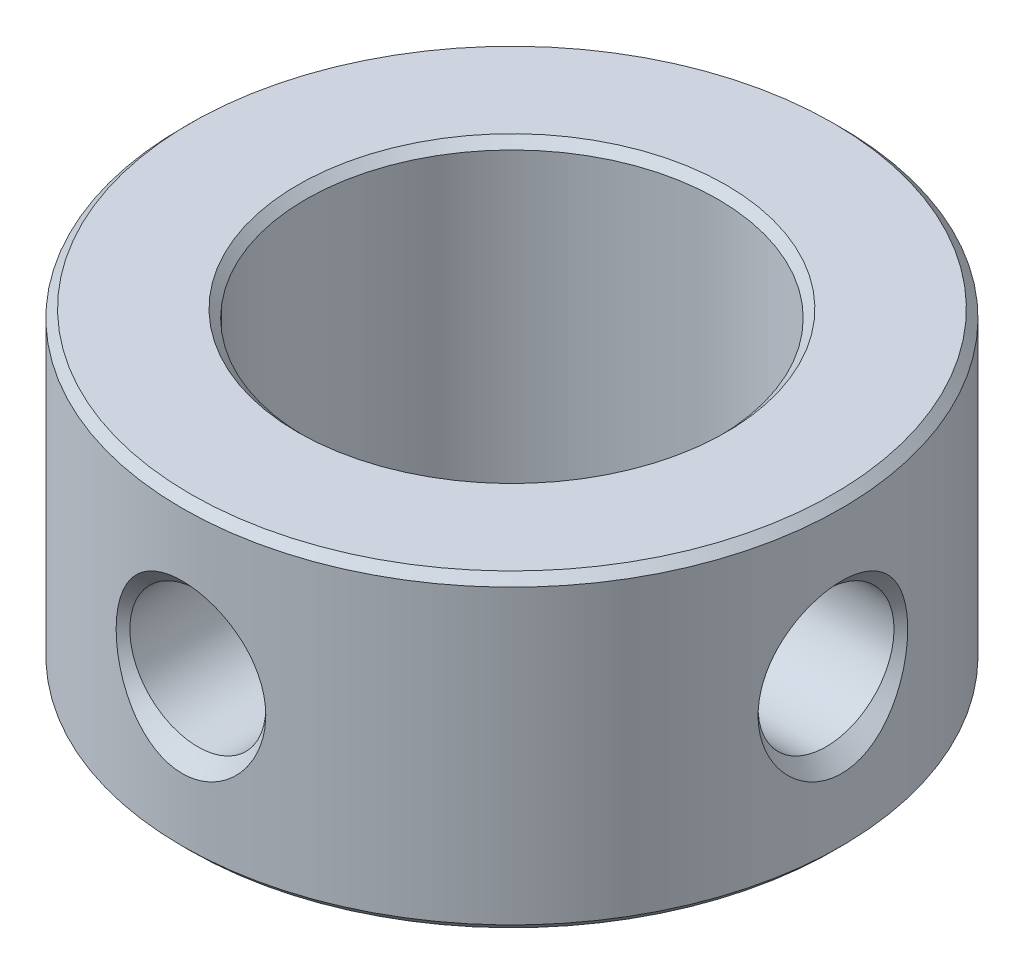
ISO-10303-21;
HEADER;
FILE_DESCRIPTION(('STEP AP214'),'2;1');
FILE_NAME('part.step','',(''),(''),'','','');
FILE_SCHEMA(('AUTOMOTIVE_DESIGN { 1 0 10303 214 1 1 1 1 }'));
ENDSEC;
DATA;
#1=APPLICATION_CONTEXT('core data for automotive mechanical design processes');
#2=APPLICATION_PROTOCOL_DEFINITION('international standard','automotive_design',2000,#1);
#3=PRODUCT_CONTEXT('',#1,'mechanical');
#4=PRODUCT('Part','Part','',(#3));
#5=PRODUCT_RELATED_PRODUCT_CATEGORY('part','',(#4));
#6=PRODUCT_DEFINITION_FORMATION('','',#4);
#7=PRODUCT_DEFINITION_CONTEXT('part definition',#1,'design');
#8=PRODUCT_DEFINITION('design','',#6,#7);
#9=PRODUCT_DEFINITION_SHAPE('','',#8);
#10=(LENGTH_UNIT() NAMED_UNIT(*) SI_UNIT(.MILLI.,.METRE.));
#11=(NAMED_UNIT(*) PLANE_ANGLE_UNIT() SI_UNIT($,.RADIAN.));
#12=(NAMED_UNIT(*) SI_UNIT($,.STERADIAN.) SOLID_ANGLE_UNIT());
#13=UNCERTAINTY_MEASURE_WITH_UNIT(LENGTH_MEASURE(1.E-05),#10,'distance_accuracy_value','');
#14=(GEOMETRIC_REPRESENTATION_CONTEXT(3) GLOBAL_UNCERTAINTY_ASSIGNED_CONTEXT((#13)) GLOBAL_UNIT_ASSIGNED_CONTEXT((#10,
#11,#12)) REPRESENTATION_CONTEXT('',''));
#15=CARTESIAN_POINT('',(0.,0.,0.));
#16=DIRECTION('',(0.,0.,1.));
#17=DIRECTION('',(1.,0.,0.));
#18=AXIS2_PLACEMENT_3D('',#15,#16,#17);
#19=CARTESIAN_POINT('',(0.,3.75,0.));
#20=DIRECTION('',(0.,1.,0.));
#21=DIRECTION('',(0.,0.,1.));
#22=AXIS2_PLACEMENT_3D('',#19,#20,#21);
#23=PLANE('',#22);
#24=CARTESIAN_POINT('',(0.,3.75,0.));
#25=DIRECTION('',(0.,1.,0.));
#26=DIRECTION('',(0.,0.,1.));
#27=AXIS2_PLACEMENT_3D('',#24,#25,#26);
#28=CIRCLE('',#27,5.2);
#29=CARTESIAN_POINT('',(0.,3.75,5.2));
#30=VERTEX_POINT('',#29);
#31=EDGE_CURVE('E39',#30,#30,#28,.F.);
#32=ORIENTED_EDGE('',*,*,#31,.T.);
#33=EDGE_LOOP('',(#32));
#34=FACE_BOUND('',#33,.T.);
#35=CARTESIAN_POINT('',(0.,3.75,0.));
#36=DIRECTION('',(0.,1.,0.));
#37=DIRECTION('',(0.,0.,1.));
#38=AXIS2_PLACEMENT_3D('',#35,#36,#37);
#39=CIRCLE('',#38,7.8);
#40=CARTESIAN_POINT('',(0.,3.75,7.8));
#41=VERTEX_POINT('',#40);
#42=EDGE_CURVE('E61',#41,#41,#39,.T.);
#43=ORIENTED_EDGE('',*,*,#42,.T.);
#44=EDGE_LOOP('',(#43));
#45=FACE_BOUND('',#44,.T.);
#46=ADVANCED_FACE('F32',(#34,#45),#23,.T.);
#47=CARTESIAN_POINT('',(0.,-3.75,0.));
#48=DIRECTION('',(0.,1.,0.));
#49=DIRECTION('',(0.,0.,1.));
#50=AXIS2_PLACEMENT_3D('',#47,#48,#49);
#51=PLANE('',#50);
#52=CARTESIAN_POINT('',(0.,-3.75,0.));
#53=DIRECTION('',(0.,1.,0.));
#54=DIRECTION('',(0.,0.,1.));
#55=AXIS2_PLACEMENT_3D('',#52,#53,#54);
#56=CIRCLE('',#55,5.2);
#57=CARTESIAN_POINT('',(0.,-3.75,5.2));
#58=VERTEX_POINT('',#57);
#59=EDGE_CURVE('E10',#58,#58,#56,.T.);
#60=ORIENTED_EDGE('',*,*,#59,.T.);
#61=EDGE_LOOP('',(#60));
#62=FACE_BOUND('',#61,.T.);
#63=CARTESIAN_POINT('',(0.,-3.75,0.));
#64=DIRECTION('',(0.,1.,0.));
#65=DIRECTION('',(0.,0.,1.));
#66=AXIS2_PLACEMENT_3D('',#63,#64,#65);
#67=CIRCLE('',#66,7.8);
#68=CARTESIAN_POINT('',(0.,-3.75,7.8));
#69=VERTEX_POINT('',#68);
#70=EDGE_CURVE('E52',#69,#69,#67,.F.);
#71=ORIENTED_EDGE('',*,*,#70,.T.);
#72=EDGE_LOOP('',(#71));
#73=FACE_BOUND('',#72,.T.);
#74=ADVANCED_FACE('F130',(#62,#73),#51,.F.);
#75=CARTESIAN_POINT('',(0.,3.75,0.));
#76=DIRECTION('',(0.,-1.,0.));
#77=DIRECTION('',(0.,0.,-1.));
#78=AXIS2_PLACEMENT_3D('',#75,#76,#77);
#79=CYLINDRICAL_SURFACE('',#78,8.);
#80=CARTESIAN_POINT('',(0.,3.55,0.));
#81=DIRECTION('',(0.,1.,0.));
#82=DIRECTION('',(0.,0.,1.));
#83=AXIS2_PLACEMENT_3D('',#80,#81,#82);
#84=CIRCLE('',#83,8.);
#85=CARTESIAN_POINT('',(0.,3.55,8.));
#86=VERTEX_POINT('',#85);
#87=EDGE_CURVE('E55',#86,#86,#84,.F.);
#88=ORIENTED_EDGE('',*,*,#87,.T.);
#89=EDGE_LOOP('',(#88));
#90=FACE_BOUND('',#89,.T.);
#91=CARTESIAN_POINT('',(0.,-3.55,0.));
#92=DIRECTION('',(0.,1.,0.));
#93=DIRECTION('',(0.,0.,1.));
#94=AXIS2_PLACEMENT_3D('',#91,#92,#93);
#95=CIRCLE('',#94,8.);
#96=CARTESIAN_POINT('',(0.,-3.55,8.));
#97=VERTEX_POINT('',#96);
#98=EDGE_CURVE('E58',#97,#97,#95,.T.);
#99=ORIENTED_EDGE('',*,*,#98,.T.);
#100=EDGE_LOOP('',(#99));
#101=FACE_BOUND('',#100,.T.);
#102=CARTESIAN_POINT('',(7.88725510410815,-1.36583766069958,-1.33835982872653));
#103=CARTESIAN_POINT('',(7.89739681602595,-1.43860886980372,-1.27858819017871));
#104=CARTESIAN_POINT('',(7.90772236569113,-1.50707948431465,-1.21362903791426));
#105=CARTESIAN_POINT('',(7.92787502445625,-1.63362294887884,-1.07413303537246));
#106=CARTESIAN_POINT('',(7.93770205357823,-1.6916941343025,-0.999594655028545));
#107=CARTESIAN_POINT('',(7.95716516063902,-1.80241936115597,-0.831607884611095));
#108=CARTESIAN_POINT('',(7.96660095694601,-1.85331785735637,-0.736963327628972));
#109=CARTESIAN_POINT('',(7.982396744113,-1.93647240518105,-0.539544563384977));
#110=CARTESIAN_POINT('',(7.98875829366974,-1.96873790568088,-0.436774506714666));
#111=CARTESIAN_POINT('',(7.99700095825641,-2.01018882512739,-0.238229006284151));
#112=CARTESIAN_POINT('',(7.9992953182243,-2.02150900809473,-0.142914450717224));
#113=CARTESIAN_POINT('',(8.00042440745517,-2.02710324197324,0.0482111537547259));
#114=CARTESIAN_POINT('',(7.99926078640053,-2.02138542111946,0.144021944152301));
#115=CARTESIAN_POINT('',(7.99380789774318,-1.99416593034385,0.326922187659782));
#116=CARTESIAN_POINT('',(7.98972476106583,-1.97370452140549,0.414175918319122));
#117=CARTESIAN_POINT('',(7.97910030835475,-1.91915163233458,0.584135608897859));
#118=CARTESIAN_POINT('',(7.97255870881883,-1.88505858021489,0.666841043060651));
#119=CARTESIAN_POINT('',(7.95738687903795,-1.80318419683851,0.82876674905741));
#120=CARTESIAN_POINT('',(7.9486892340512,-1.75494939533931,0.907750249633318));
#121=CARTESIAN_POINT('',(7.93017220762528,-1.64713715678737,1.05738570632043));
#122=CARTESIAN_POINT('',(7.92035241249931,-1.58755553123552,1.12803457018853));
#123=CARTESIAN_POINT('',(7.89941121101303,-1.45218649368848,1.26677808538215));
#124=CARTESIAN_POINT('',(7.88826015872866,-1.37536068144245,1.33385442115752));
#125=CARTESIAN_POINT('',(7.86669776635073,-1.21238042514961,1.45564388248628));
#126=CARTESIAN_POINT('',(7.85628676496414,-1.12622175458668,1.51035137171919));
#127=CARTESIAN_POINT('',(7.83611566328109,-0.937065986120456,1.61191323576617));
#128=CARTESIAN_POINT('',(7.82654571973213,-0.833254354326015,1.65729205131895));
#129=CARTESIAN_POINT('',(7.81048343977299,-0.619627250981955,1.73141257860072));
#130=CARTESIAN_POINT('',(7.80399203833629,-0.509809966755655,1.76014923658219));
#131=CARTESIAN_POINT('',(7.79447842525019,-0.27991358871225,1.80183370353196));
#132=CARTESIAN_POINT('',(7.79169935219886,-0.159622885683257,1.81367812307864));
#133=CARTESIAN_POINT('',(7.79071655129548,0.0813242980254866,1.81789379949077));
#134=CARTESIAN_POINT('',(7.79251348293863,0.201980828925408,1.81026224947317));
#135=CARTESIAN_POINT('',(7.80054081493752,0.442372326981624,1.7753559314282));
#136=CARTESIAN_POINT('',(7.80684577673287,0.562057088444893,1.74775071193633));
#137=CARTESIAN_POINT('',(7.82320831570274,0.794920823331452,1.67298153005878));
#138=CARTESIAN_POINT('',(7.83326642968549,0.908098863433606,1.62581476970511));
#139=CARTESIAN_POINT('',(7.8557615153723,1.12313944347954,1.51335754480519));
#140=CARTESIAN_POINT('',(7.86816930475247,1.2251187917495,1.44828538444375));
#141=CARTESIAN_POINT('',(7.8938768653106,1.4156756843124,1.30087822336123));
#142=CARTESIAN_POINT('',(7.90717643647745,1.50425621931093,1.21854708477827));
#143=CARTESIAN_POINT('',(7.93205598389675,1.65919652610796,1.0439183091388));
#144=CARTESIAN_POINT('',(7.94369143622925,1.72659113693389,0.952550876440163));
#145=CARTESIAN_POINT('',(7.96456379203474,1.84277418464639,0.758418357442723));
#146=CARTESIAN_POINT('',(7.97380332981378,1.89158308441554,0.655665967906818));
#147=CARTESIAN_POINT('',(7.98762272239615,1.96311251471819,0.454755021393487));
#148=CARTESIAN_POINT('',(7.99262270035408,1.98822558163853,0.357476680579581));
#149=CARTESIAN_POINT('',(7.99901139448469,2.02016152017765,0.159861723506759));
#150=CARTESIAN_POINT('',(8.00040267039491,2.02699735637364,0.0595273261202028));
#151=CARTESIAN_POINT('',(7.99944025778874,2.02222530139168,-0.131030873444452));
#152=CARTESIAN_POINT('',(7.99743190952356,2.01231833775373,-0.221304159775034));
#153=CARTESIAN_POINT('',(7.99054508022457,1.97775263823959,-0.398850479403227));
#154=CARTESIAN_POINT('',(7.9856666826559,1.95309433135319,-0.486123599871834));
#155=CARTESIAN_POINT('',(7.97355584474197,1.89016586582776,-0.655461411830023));
#156=CARTESIAN_POINT('',(7.96632197752287,1.85188745522586,-0.73752291017412));
#157=CARTESIAN_POINT('',(7.95021021509912,1.76327155506703,-0.894654460328953));
#158=CARTESIAN_POINT('',(7.94133184962581,1.71293061483856,-0.969722503005037));
#159=CARTESIAN_POINT('',(7.921917011649,1.59708467974292,-1.11771001358868));
#160=CARTESIAN_POINT('',(7.91130359382215,1.53064727306536,-1.18988805283623));
#161=CARTESIAN_POINT('',(7.89007021317852,1.38765606785779,-1.32339382956808));
#162=CARTESIAN_POINT('',(7.8794502495856,1.31109766543021,-1.38471659927193));
#163=CARTESIAN_POINT('',(7.85798085899198,1.14072801483068,-1.50202982280101));
#164=CARTESIAN_POINT('',(7.84724155731489,1.04594478277444,-1.5566307316863));
#165=CARTESIAN_POINT('',(7.82799816344493,0.848930221936532,-1.65068273917688));
#166=CARTESIAN_POINT('',(7.81949489862135,0.746696154046492,-1.69012823251909));
#167=CARTESIAN_POINT('',(7.80499578448182,0.528709414280086,-1.75592750188839));
#168=CARTESIAN_POINT('',(7.79926169102938,0.412534789575671,-1.7809476800683));
#169=CARTESIAN_POINT('',(7.79205132671697,0.177551728348718,-1.8122345302998));
#170=CARTESIAN_POINT('',(7.79057593281147,0.05874275443393,-1.81849733983059));
#171=CARTESIAN_POINT('',(7.79207545490378,-0.182003266117995,-1.8120640526144));
#172=CARTESIAN_POINT('',(7.79518858244532,-0.3039241877997,-1.79877917781435));
#173=CARTESIAN_POINT('',(7.80574842324515,-0.543764710507947,-1.7523846527222));
#174=CARTESIAN_POINT('',(7.81319545189167,-0.661684019666671,-1.71927355962423));
#175=CARTESIAN_POINT('',(7.83092678711152,-0.882708778771738,-1.63653469496718));
#176=CARTESIAN_POINT('',(7.84099879002972,-0.986279301981149,-1.58810079019202));
#177=CARTESIAN_POINT('',(7.86304408631651,-1.18392819467795,-1.47507360341182));
#178=CARTESIAN_POINT('',(7.87501571965002,-1.27801473564244,-1.41049440223918));
#179=CARTESIAN_POINT('',(7.88725510410815,-1.36583766069958,-1.33835982872653));
#180=B_SPLINE_CURVE_WITH_KNOTS('',3,(#102,#103,#104,#105,#106,#107,#108,#109,#110,#111,#112,
#113,#114,#115,#116,#117,#118,#119,#120,#121,#122,#123,#124,#125,#126,#127,#128,#129,#130,#131,
#132,#133,#134,#135,#136,#137,#138,#139,#140,#141,#142,#143,#144,#145,#146,#147,#148,#149,#150,
#151,#152,#153,#154,#155,#156,#157,#158,#159,#160,#161,#162,#163,#164,#165,#166,#167,#168,#169,
#170,#171,#172,#173,#174,#175,#176,#177,#178,#179),.UNSPECIFIED.,.T.,.F.,(4,2,2,2,2,2,2,2,2,2,2,
2,2,2,2,2,2,2,2,2,2,2,2,2,2,2,2,2,2,2,2,2,2,2,2,2,2,2,4),(0.,0.283859857117584,
0.567765110956834,0.889536386674303,1.21114434712809,1.49764929327823,1.78401757983654,
2.05194258314755,2.31989849221092,2.59761729430366,2.87543881126853,3.18196867125888,
3.48863793259663,3.82826063048602,4.16798640807391,4.52902098798788,4.89010760326087,
5.25730888976448,5.62456271670886,5.98752349049351,6.35040312905266,6.69085982591043,
7.03094058833071,7.331038105931,7.63092269899433,7.90213513353999,8.17333968123008,
8.44470882320707,8.71615568736035,9.0109730678795,9.30592502109126,9.63426740944553,
9.96273111930727,10.3180422537087,10.6734265488157,11.039736519123,11.4060731500071,
11.7489434755357,12.0915158096396),.UNSPECIFIED.);
#181=CARTESIAN_POINT('',(7.88725510410815,-1.36583766069958,-1.33835982872653));
#182=VERTEX_POINT('',#181);
#183=EDGE_CURVE('E64',#182,#182,#180,.T.);
#184=ORIENTED_EDGE('',*,*,#183,.T.);
#185=EDGE_LOOP('',(#184));
#186=FACE_BOUND('',#185,.T.);
#187=CARTESIAN_POINT('',(-1.3383598287265,-1.36583766069958,7.88725510410815));
#188=CARTESIAN_POINT('',(-1.41170413311371,-1.27653817882784,7.87481033742301));
#189=CARTESIAN_POINT('',(-1.47728321321789,-1.18070127703216,7.86263410077733));
#190=CARTESIAN_POINT('',(-1.59176194811959,-0.979204940478396,7.84026250833114));
#191=CARTESIAN_POINT('',(-1.64063087024733,-0.873527857197293,7.83007081708701));
#192=CARTESIAN_POINT('',(-1.72100770649194,-0.655091133582315,7.81279932035607));
#193=CARTESIAN_POINT('',(-1.75245256260931,-0.542307392377088,7.80573083626055));
#194=CARTESIAN_POINT('',(-1.79721374516216,-0.313086494214983,7.79554696727406));
#195=CARTESIAN_POINT('',(-1.81053688015437,-0.196650726200835,7.7924300977421));
#196=CARTESIAN_POINT('',(-1.81904965333753,0.0419496371192778,7.79044840047274));
#197=CARTESIAN_POINT('',(-1.81343508596477,0.164145319874912,7.79177213393712));
#198=CARTESIAN_POINT('',(-1.78237082975267,0.405885796890232,7.79893599143359));
#199=CARTESIAN_POINT('',(-1.75691593987457,0.525429887596353,7.80477729972163));
#200=CARTESIAN_POINT('',(-1.68645963505265,0.75885481478236,7.82030396805208));
#201=CARTESIAN_POINT('',(-1.64138610039736,0.872713011255727,7.83000349979347));
#202=CARTESIAN_POINT('',(-1.53239748276877,1.09080207316936,7.85205943100922));
#203=CARTESIAN_POINT('',(-1.46848116680311,1.19503230800995,7.86441600433489));
#204=CARTESIAN_POINT('',(-1.3250704044391,1.3872774167194,7.88982390575823));
#205=CARTESIAN_POINT('',(-1.24609465182157,1.47568176179882,7.90284372632592));
#206=CARTESIAN_POINT('',(-1.07297084581299,1.6363004280664,7.92819967782814));
#207=CARTESIAN_POINT('',(-0.978832865259455,1.70852542216726,7.94053625540476));
#208=CARTESIAN_POINT('',(-0.787030076589696,1.82731770905041,7.9617219126718));
#209=CARTESIAN_POINT('',(-0.690470253574915,1.87562446906329,7.97078646442859));
#210=CARTESIAN_POINT('',(-0.489711803581817,1.95302140304109,7.98562824690539));
#211=CARTESIAN_POINT('',(-0.385521721168743,1.98213271775377,7.99140909313206));
#212=CARTESIAN_POINT('',(-0.18611840636867,2.01702915490541,7.99838094852231));
#213=CARTESIAN_POINT('',(-0.0913348026614285,2.02520083501288,8.00004079092892));
#214=CARTESIAN_POINT('',(0.0981814392946561,2.02479191397994,7.9999577444807));
#215=CARTESIAN_POINT('',(0.192914083928997,2.016216989873,7.99821600874757));
#216=CARTESIAN_POINT('',(0.374003289245471,1.98376567188912,7.99173803777931));
#217=CARTESIAN_POINT('',(0.46052988835945,1.9607866990389,7.98717763348972));
#218=CARTESIAN_POINT('',(0.628679415872557,1.90144716299212,7.97570503521687));
#219=CARTESIAN_POINT('',(0.710301707322969,1.86508486598258,7.96879253652797));
#220=CARTESIAN_POINT('',(0.870391667878321,1.77854617945623,7.95293543091084));
#221=CARTESIAN_POINT('',(0.948556638930005,1.72782637451953,7.94391399059008));
#222=CARTESIAN_POINT('',(1.09621835901505,1.61521248988666,7.92488858608386));
#223=CARTESIAN_POINT('',(1.16571173187928,1.55331408076378,7.91488424191079));
#224=CARTESIAN_POINT('',(1.30191232300601,1.41307903493489,7.89368562523889));
#225=CARTESIAN_POINT('',(1.36753800863951,1.33369442678286,7.8824779152605));
#226=CARTESIAN_POINT('',(1.4860430517811,1.16581444462395,7.86099930986731));
#227=CARTESIAN_POINT('',(1.53891665740775,1.07731498491043,7.85072883849157));
#228=CARTESIAN_POINT('',(1.63611470115427,0.883731730973365,7.83108236883595));
#229=CARTESIAN_POINT('',(1.67895995805141,0.777882144775569,7.82191330282649));
#230=CARTESIAN_POINT('',(1.74767000674032,0.560586465619506,7.80684887109571));
#231=CARTESIAN_POINT('',(1.77352997303875,0.449138791925669,7.80095443576488));
#232=CARTESIAN_POINT('',(1.80887876512282,0.216902152056331,7.79283760008622));
#233=CARTESIAN_POINT('',(1.81733209770219,0.0959461112443887,7.7908477759683));
#234=CARTESIAN_POINT('',(1.81464742958053,-0.145744296975187,7.7914731272954));
#235=CARTESIAN_POINT('',(1.80350669045263,-0.26647863103682,7.79408894641563));
#236=CARTESIAN_POINT('',(1.76152385767787,-0.506060053600264,7.80368516511054));
#237=CARTESIAN_POINT('',(1.73040734534757,-0.624856843720785,7.81072632947477));
#238=CARTESIAN_POINT('',(1.64872343116766,-0.855325655395811,7.82837451415271));
#239=CARTESIAN_POINT('',(1.59815332973,-0.966996685595014,7.83898202934564));
#240=CARTESIAN_POINT('',(1.47927561951103,-1.17807996112887,7.86227372192069));
#241=CARTESIAN_POINT('',(1.41123986406191,-1.27764836563501,7.87492505729425));
#242=CARTESIAN_POINT('',(1.25825353702386,-1.46279884309713,7.90080963227325));
#243=CARTESIAN_POINT('',(1.1733080466252,-1.54838510350247,7.91404269614717));
#244=CARTESIAN_POINT('',(0.994621182199664,-1.69649578979629,7.93840583932307));
#245=CARTESIAN_POINT('',(0.901863873348556,-1.76018881338356,7.94961762825355));
#246=CARTESIAN_POINT('',(0.705664988223893,-1.86874128806348,7.96942289223697));
#247=CARTESIAN_POINT('',(0.602235621117201,-1.91362196979086,7.97801931583423));
#248=CARTESIAN_POINT('',(0.401060397434244,-1.97765789823812,7.9904984321935));
#249=CARTESIAN_POINT('',(0.304115949800717,-1.99924925220486,7.99482215755886));
#250=CARTESIAN_POINT('',(0.107841629003534,-2.02441256217658,7.99987355672001));
#251=CARTESIAN_POINT('',(0.00851338838205845,-2.02799651559412,8.00060362477978));
#252=CARTESIAN_POINT('',(-0.180230430545424,-2.01745078557005,7.99847716207752));
#253=CARTESIAN_POINT('',(-0.269740972253015,-2.00487029162763,7.99593427119143));
#254=CARTESIAN_POINT('',(-0.445377743557239,-1.96524927307519,7.98807665296964));
#255=CARTESIAN_POINT('',(-0.531503296905257,-1.9382058746896,7.98276137476646));
#256=CARTESIAN_POINT('',(-0.69904229317204,-1.87055291097395,7.96984839711081));
#257=CARTESIAN_POINT('',(-0.78039915647992,-1.8298086793638,7.96222811947579));
#258=CARTESIAN_POINT('',(-0.935736994232825,-1.73645763350549,7.94547054230361));
#259=CARTESIAN_POINT('',(-1.00972202455813,-1.68385739481996,7.93633408440632));
#260=CARTESIAN_POINT('',(-1.12667295604545,-1.58712058841723,7.92040967896829));
#261=CARTESIAN_POINT('',(-1.17195794372938,-1.54570947842631,7.91381239220112));
#262=CARTESIAN_POINT('',(-1.25834385495222,-1.45875820936235,7.90053657232343));
#263=CARTESIAN_POINT('',(-1.29944485336124,-1.41321812420256,7.89385804066914));
#264=CARTESIAN_POINT('',(-1.3383598287265,-1.36583766069958,7.88725510410815));
#265=B_SPLINE_CURVE_WITH_KNOTS('',3,(#187,#188,#189,#190,#191,#192,#193,#194,#195,#196,#197,
#198,#199,#200,#201,#202,#203,#204,#205,#206,#207,#208,#209,#210,#211,#212,#213,#214,#215,#216,
#217,#218,#219,#220,#221,#222,#223,#224,#225,#226,#227,#228,#229,#230,#231,#232,#233,#234,#235,
#236,#237,#238,#239,#240,#241,#242,#243,#244,#245,#246,#247,#248,#249,#250,#251,#252,#253,#254,
#255,#256,#257,#258,#259,#260,#261,#262,#263,#264),.UNSPECIFIED.,.T.,.F.,(4,2,2,2,2,2,2,2,2,2,2,
2,2,2,2,2,2,2,2,2,2,2,2,2,2,2,2,2,2,2,2,2,2,2,2,2,2,2,4),(0.,0.348450920185695,
0.697539293504841,1.04788290741681,1.39809485646919,1.76336284439314,2.12872661766384,
2.49544499338223,2.86218737093744,3.21804425101093,3.57366568977905,3.89684841573091,
4.21967460985182,4.50363082081152,4.78749078843241,5.05521647388626,5.32297685548439,
5.60267016425719,5.88247203029661,6.19201860048867,6.50170453298249,6.84388522012308,
7.18616307823845,7.54827492402963,7.91043738184359,8.27768474526009,8.64498309024284,
9.00687862877488,9.36866558536499,9.70597286323275,10.0428984419434,10.3394979167735,
10.635899756273,10.9059033573352,11.1759606279904,11.4487539131712,11.7213962727738,
11.9062804540758,12.0911613263988),.UNSPECIFIED.);
#266=CARTESIAN_POINT('',(-1.3383598287265,-1.36583766069958,7.88725510410815));
#267=VERTEX_POINT('',#266);
#268=EDGE_CURVE('E72',#267,#267,#265,.T.);
#269=ORIENTED_EDGE('',*,*,#268,.T.);
#270=EDGE_LOOP('',(#269));
#271=FACE_BOUND('',#270,.T.);
#272=ADVANCED_FACE('F78',(#90,#101,#186,#271),#79,.T.);
#273=CARTESIAN_POINT('',(0.,3.75,0.));
#274=DIRECTION('',(0.,-1.,0.));
#275=DIRECTION('',(0.,0.,-1.));
#276=AXIS2_PLACEMENT_3D('',#273,#274,#275);
#277=CYLINDRICAL_SURFACE('',#276,5.);
#278=CARTESIAN_POINT('',(0.,3.55,0.));
#279=DIRECTION('',(0.,1.,0.));
#280=DIRECTION('',(0.,0.,1.));
#281=AXIS2_PLACEMENT_3D('',#278,#279,#280);
#282=CIRCLE('',#281,5.);
#283=CARTESIAN_POINT('',(0.,3.55,5.));
#284=VERTEX_POINT('',#283);
#285=EDGE_CURVE('E43',#284,#284,#282,.T.);
#286=ORIENTED_EDGE('',*,*,#285,.T.);
#287=EDGE_LOOP('',(#286));
#288=FACE_BOUND('',#287,.T.);
#289=CARTESIAN_POINT('',(0.,-3.55,0.));
#290=DIRECTION('',(0.,1.,0.));
#291=DIRECTION('',(0.,0.,1.));
#292=AXIS2_PLACEMENT_3D('',#289,#290,#291);
#293=CIRCLE('',#292,5.);
#294=CARTESIAN_POINT('',(0.,-3.55,5.));
#295=VERTEX_POINT('',#294);
#296=EDGE_CURVE('E47',#295,#295,#293,.F.);
#297=ORIENTED_EDGE('',*,*,#296,.T.);
#298=EDGE_LOOP('',(#297));
#299=FACE_BOUND('',#298,.T.);
#300=CARTESIAN_POINT('',(4.71990466005405,0.,-1.65000000000002));
#301=CARTESIAN_POINT('',(4.71990452115882,-0.0899293992906261,-1.65000024360505));
#302=CARTESIAN_POINT('',(4.72250292266518,-0.179857686499693,-1.64262303818657));
#303=CARTESIAN_POINT('',(4.73256311651637,-0.357053673435176,-1.61340616817485));
#304=CARTESIAN_POINT('',(4.74002579119602,-0.444320887460395,-1.59156387973591));
#305=CARTESIAN_POINT('',(4.75887919770346,-0.613599699379074,-1.5342646581981));
#306=CARTESIAN_POINT('',(4.77026235105613,-0.695621077663532,-1.49883397722408));
#307=CARTESIAN_POINT('',(4.79566317693292,-0.852581496357103,-1.41545303535857));
#308=CARTESIAN_POINT('',(4.80968141232601,-0.927519018463693,-1.36750009878648));
#309=CARTESIAN_POINT('',(4.83937566103107,-1.07105763938824,-1.25846654308767));
#310=CARTESIAN_POINT('',(4.85509238793418,-1.13934748573353,-1.19698715979912));
#311=CARTESIAN_POINT('',(4.8860682262247,-1.26485926767889,-1.06349727663173));
#312=CARTESIAN_POINT('',(4.90132726544298,-1.322079465466,-0.991485126335493));
#313=CARTESIAN_POINT('',(4.93013890958224,-1.42523358902282,-0.836704215602416));
#314=CARTESIAN_POINT('',(4.94363804307574,-1.47084230640669,-0.75370788727838));
#315=CARTESIAN_POINT('',(4.9669298740668,-1.54732873484977,-0.580699685040902));
#316=CARTESIAN_POINT('',(4.97672354920831,-1.57821033205654,-0.490689669179521));
#317=CARTESIAN_POINT('',(4.99121262924257,-1.62331307187515,-0.309471831071075));
#318=CARTESIAN_POINT('',(4.99607073696453,-1.63806721498854,-0.218409916306862));
#319=CARTESIAN_POINT('',(5.00071837425094,-1.65218999871481,-0.0349820134684329));
#320=CARTESIAN_POINT('',(5.00050918484354,-1.65156252784608,0.0573836391159306));
#321=CARTESIAN_POINT('',(4.99515654976729,-1.63528002545685,0.237027933093908));
#322=CARTESIAN_POINT('',(4.99020313675408,-1.6202037350628,0.324365615952672));
#323=CARTESIAN_POINT('',(4.9761564157389,-1.57640739681431,0.495193577668994));
#324=CARTESIAN_POINT('',(4.96706282865059,-1.54768642917574,0.578683596740267));
#325=CARTESIAN_POINT('',(4.94551338736032,-1.47707262193577,0.740723104693046));
#326=CARTESIAN_POINT('',(4.93301533884174,-1.43501331574259,0.81919420758658));
#327=CARTESIAN_POINT('',(4.90596050876768,-1.33905332496135,0.968137400016363));
#328=CARTESIAN_POINT('',(4.89140316323876,-1.28514939427669,1.03860728872216));
#329=CARTESIAN_POINT('',(4.86097294536879,-1.16410482353283,1.17299175258729));
#330=CARTESIAN_POINT('',(4.84507036749807,-1.09646769426564,1.23645304594367));
#331=CARTESIAN_POINT('',(4.81431124792123,-0.951373410364429,1.3512770038306));
#332=CARTESIAN_POINT('',(4.79945486104327,-0.873914806958852,1.40263788022028));
#333=CARTESIAN_POINT('',(4.77230967313123,-0.709965601142442,1.49241382326106));
#334=CARTESIAN_POINT('',(4.76005891661915,-0.623365612338627,1.53064150543128));
#335=CARTESIAN_POINT('',(4.73995346804782,-0.444452392842491,1.59181981773762));
#336=CARTESIAN_POINT('',(4.73209697762928,-0.352141516541729,1.61477669819904));
#337=CARTESIAN_POINT('',(4.72207527963098,-0.168809832300748,1.64384682592319));
#338=CARTESIAN_POINT('',(4.71967327795615,-0.0779131556508038,1.65066145601708));
#339=CARTESIAN_POINT('',(4.72017136658521,0.103737847887934,1.64923749492085));
#340=CARTESIAN_POINT('',(4.72307051828915,0.194492197129191,1.64100156851916));
#341=CARTESIAN_POINT('',(4.73360855675225,0.370120072236671,1.61033997123773));
#342=CARTESIAN_POINT('',(4.7410857342646,0.455088769396758,1.58839792719589));
#343=CARTESIAN_POINT('',(4.75976051805483,0.620122607016738,1.53152522846695));
#344=CARTESIAN_POINT('',(4.77095877549975,0.700186886326101,1.4965923003242));
#345=CARTESIAN_POINT('',(4.79624726899172,0.855910027040811,1.41348842564753));
#346=CARTESIAN_POINT('',(4.81041691149477,0.931353169025618,1.36493806698653));
#347=CARTESIAN_POINT('',(4.83989585604413,1.07327560374667,1.25640957990471));
#348=CARTESIAN_POINT('',(4.85520548680903,1.13975229532687,1.19642814746823));
#349=CARTESIAN_POINT('',(4.88610989384612,1.26508318078348,1.06339123842033));
#350=CARTESIAN_POINT('',(4.90168425037641,1.32343223892653,0.989853763923032));
#351=CARTESIAN_POINT('',(4.93065204495412,1.42699264159109,0.833649177353387));
#352=CARTESIAN_POINT('',(4.94404556482344,1.47220447905245,0.750982407994623));
#353=CARTESIAN_POINT('',(4.96707750850083,1.54778899225878,0.57929571537978));
#354=CARTESIAN_POINT('',(4.976740841375,1.57826045874353,0.490322802958586));
#355=CARTESIAN_POINT('',(4.99133146825929,1.62368669319226,0.308134735858237));
#356=CARTESIAN_POINT('',(4.99626043401974,1.63864693846524,0.214921090808585));
#357=CARTESIAN_POINT('',(5.00070328980923,1.65214081785687,0.0315225864698824));
#358=CARTESIAN_POINT('',(5.00045646732493,1.65140031208918,-0.0586036580668877));
#359=CARTESIAN_POINT('',(4.99516201889143,1.63529847572636,-0.237388028290549));
#360=CARTESIAN_POINT('',(4.99011476942583,1.61993829171028,-0.326046268554008));
#361=CARTESIAN_POINT('',(4.97587240449465,1.57551169407576,-0.498029665785535));
#362=CARTESIAN_POINT('',(4.96674195827475,1.54665866508083,-0.581415680377176));
#363=CARTESIAN_POINT('',(4.94527347683187,1.47626210521859,-0.742196807428938));
#364=CARTESIAN_POINT('',(4.93293486552038,1.43471629488055,-0.819590840669566));
#365=CARTESIAN_POINT('',(4.90576374946711,1.33836734607494,-0.969268380933038));
#366=CARTESIAN_POINT('',(4.89085668492739,1.28313585190305,-1.04126244269288));
#367=CARTESIAN_POINT('',(4.86041514438607,1.1617163493559,-1.17519818555168));
#368=CARTESIAN_POINT('',(4.84488047141097,1.09552488070222,-1.2371366796408));
#369=CARTESIAN_POINT('',(4.81423121094682,0.951044148545361,-1.35160179814248));
#370=CARTESIAN_POINT('',(4.79915525016868,0.872389730510838,-1.40367929286431));
#371=CARTESIAN_POINT('',(4.77186368687929,0.706978337875821,-1.49383628223879));
#372=CARTESIAN_POINT('',(4.75964726749499,0.620223687165055,-1.53191977627392));
#373=CARTESIAN_POINT('',(4.74014636717988,0.445656727556768,-1.59120734764473));
#374=CARTESIAN_POINT('',(4.73263920267759,0.358131958064789,-1.61318355190479));
#375=CARTESIAN_POINT('',(4.72251921935149,0.18040382870731,-1.6425773745118));
#376=CARTESIAN_POINT('',(4.71990479936932,0.0902013549447427,-1.64999975565829));
#377=CARTESIAN_POINT('',(4.71990466005405,0.,-1.65000000000002));
#378=B_SPLINE_CURVE_WITH_KNOTS('',3,(#300,#301,#302,#303,#304,#305,#306,#307,#308,#309,#310,
#311,#312,#313,#314,#315,#316,#317,#318,#319,#320,#321,#322,#323,#324,#325,#326,#327,#328,#329,
#330,#331,#332,#333,#334,#335,#336,#337,#338,#339,#340,#341,#342,#343,#344,#345,#346,#347,#348,
#349,#350,#351,#352,#353,#354,#355,#356,#357,#358,#359,#360,#361,#362,#363,#364,#365,#366,#367,
#368,#369,#370,#371,#372,#373,#374,#375,#376,#377),.UNSPECIFIED.,.T.,.F.,(4,2,2,2,2,2,2,2,2,2,2,
2,2,2,2,2,2,2,2,2,2,2,2,2,2,2,2,2,2,2,2,2,2,2,2,2,2,2,4),(0.,0.269454302916434,
0.538957495994024,0.807942623457629,1.07698527314817,1.3553904348317,1.63383926765626,
1.91939248597707,2.2048703116341,2.48059787689522,2.75625573811558,3.02131448573183,
3.2863911034247,3.55491555402299,3.82351368748603,4.10452131305698,4.38557043856028,
4.67047751353534,4.95526790443248,5.22743703243199,5.49955797597573,5.76258081799807,
6.02564971172707,6.29693565916083,6.56830013781585,6.85241935986189,7.13652791970021,
7.4187050399578,7.70078248410447,7.96984890311455,8.23889422176275,8.50382155957889,
8.76879650315115,9.04343817678384,9.31816672608183,9.60337461850676,9.88850093710113,
10.1588585876967,10.4291277478431),.UNSPECIFIED.);
#379=CARTESIAN_POINT('',(4.71990466005405,0.,-1.65000000000002));
#380=VERTEX_POINT('',#379);
#381=EDGE_CURVE('E96',#380,#380,#378,.T.);
#382=ORIENTED_EDGE('',*,*,#381,.F.);
#383=EDGE_LOOP('',(#382));
#384=FACE_BOUND('',#383,.T.);
#385=CARTESIAN_POINT('',(1.65,0.,4.71990466005406));
#386=CARTESIAN_POINT('',(1.65000024360503,-0.089929399290626,4.71990452115883));
#387=CARTESIAN_POINT('',(1.64262303818655,-0.179857686499693,4.72250292266519));
#388=CARTESIAN_POINT('',(1.61340616817484,-0.357053673435176,4.73256311651638));
#389=CARTESIAN_POINT('',(1.59156387973589,-0.444320887460394,4.74002579119602));
#390=CARTESIAN_POINT('',(1.53426465819808,-0.613599699379073,4.75887919770346));
#391=CARTESIAN_POINT('',(1.49883397722407,-0.695621077663532,4.77026235105614));
#392=CARTESIAN_POINT('',(1.41545303535855,-0.852581496357103,4.79566317693293));
#393=CARTESIAN_POINT('',(1.36750009878646,-0.927519018463693,4.80968141232602));
#394=CARTESIAN_POINT('',(1.25846654308765,-1.07105763938824,4.83937566103107));
#395=CARTESIAN_POINT('',(1.1969871597991,-1.13934748573353,4.85509238793419));
#396=CARTESIAN_POINT('',(1.06349727663171,-1.26485926767889,4.88606822622471));
#397=CARTESIAN_POINT('',(0.991485126335475,-1.322079465466,4.90132726544299));
#398=CARTESIAN_POINT('',(0.836704215602398,-1.42523358902282,4.93013890958224));
#399=CARTESIAN_POINT('',(0.753707887278362,-1.47084230640669,4.94363804307574));
#400=CARTESIAN_POINT('',(0.580699685040885,-1.54732873484976,4.9669298740668));
#401=CARTESIAN_POINT('',(0.490689669179504,-1.57821033205654,4.97672354920831));
#402=CARTESIAN_POINT('',(0.309471831071058,-1.62331307187515,4.99121262924257));
#403=CARTESIAN_POINT('',(0.218409916306845,-1.63806721498854,4.99607073696453));
#404=CARTESIAN_POINT('',(0.0349820134684156,-1.65218999871481,5.00071837425094));
#405=CARTESIAN_POINT('',(-0.0573836391159478,-1.65156252784608,5.00050918484354));
#406=CARTESIAN_POINT('',(-0.237027933093925,-1.63528002545685,4.99515654976729));
#407=CARTESIAN_POINT('',(-0.324365615952689,-1.6202037350628,4.99020313675408));
#408=CARTESIAN_POINT('',(-0.495193577669011,-1.57640739681431,4.9761564157389));
#409=CARTESIAN_POINT('',(-0.578683596740283,-1.54768642917574,4.96706282865059));
#410=CARTESIAN_POINT('',(-0.740723104693063,-1.47707262193577,4.94551338736031));
#411=CARTESIAN_POINT('',(-0.819194207586597,-1.43501331574259,4.93301533884174));
#412=CARTESIAN_POINT('',(-0.96813740001638,-1.33905332496135,4.90596050876768));
#413=CARTESIAN_POINT('',(-1.03860728872218,-1.28514939427669,4.89140316323876));
#414=CARTESIAN_POINT('',(-1.1729917525873,-1.16410482353283,4.86097294536879));
#415=CARTESIAN_POINT('',(-1.23645304594368,-1.09646769426565,4.84507036749807));
#416=CARTESIAN_POINT('',(-1.35127700383062,-0.951373410364429,4.81431124792123));
#417=CARTESIAN_POINT('',(-1.4026378802203,-0.873914806958852,4.79945486104327));
#418=CARTESIAN_POINT('',(-1.49241382326107,-0.709965601142443,4.77230967313122));
#419=CARTESIAN_POINT('',(-1.5306415054313,-0.623365612338628,4.76005891661914));
#420=CARTESIAN_POINT('',(-1.59181981773764,-0.444452392842492,4.73995346804782));
#421=CARTESIAN_POINT('',(-1.61477669819906,-0.35214151654173,4.73209697762928));
#422=CARTESIAN_POINT('',(-1.64384682592321,-0.168809832300749,4.72207527963097));
#423=CARTESIAN_POINT('',(-1.6506614560171,-0.0779131556508047,4.71967327795615));
#424=CARTESIAN_POINT('',(-1.64923749492087,0.103737847887933,4.7201713665852));
#425=CARTESIAN_POINT('',(-1.64100156851918,0.194492197129191,4.72307051828914));
#426=CARTESIAN_POINT('',(-1.61033997123775,0.370120072236671,4.73360855675225));
#427=CARTESIAN_POINT('',(-1.5883979271959,0.455088769396759,4.74108573426459));
#428=CARTESIAN_POINT('',(-1.53152522846697,0.620122607016738,4.75976051805482));
#429=CARTESIAN_POINT('',(-1.49659230032422,0.700186886326102,4.77095877549974));
#430=CARTESIAN_POINT('',(-1.41348842564754,0.855910027040811,4.79624726899171));
#431=CARTESIAN_POINT('',(-1.36493806698654,0.931353169025618,4.81041691149476));
#432=CARTESIAN_POINT('',(-1.25640957990473,1.07327560374667,4.83989585604412));
#433=CARTESIAN_POINT('',(-1.19642814746825,1.13975229532687,4.85520548680903));
#434=CARTESIAN_POINT('',(-1.06339123842035,1.26508318078348,4.88610989384612));
#435=CARTESIAN_POINT('',(-0.989853763923049,1.32343223892653,4.90168425037641));
#436=CARTESIAN_POINT('',(-0.833649177353403,1.42699264159109,4.93065204495412));
#437=CARTESIAN_POINT('',(-0.750982407994639,1.47220447905245,4.94404556482344));
#438=CARTESIAN_POINT('',(-0.579295715379798,1.54778899225878,4.96707750850083));
#439=CARTESIAN_POINT('',(-0.490322802958603,1.57826045874353,4.976740841375));
#440=CARTESIAN_POINT('',(-0.308134735858255,1.62368669319226,4.99133146825929));
#441=CARTESIAN_POINT('',(-0.214921090808603,1.63864693846524,4.99626043401974));
#442=CARTESIAN_POINT('',(-0.0315225864699003,1.65214081785686,5.00070328980923));
#443=CARTESIAN_POINT('',(0.0586036580668699,1.65140031208917,5.00045646732493));
#444=CARTESIAN_POINT('',(0.237388028290531,1.63529847572636,4.99516201889143));
#445=CARTESIAN_POINT('',(0.32604626855399,1.61993829171028,4.99011476942583));
#446=CARTESIAN_POINT('',(0.498029665785517,1.57551169407576,4.97587240449466));
#447=CARTESIAN_POINT('',(0.581415680377158,1.54665866508083,4.96674195827476));
#448=CARTESIAN_POINT('',(0.742196807428921,1.47626210521859,4.94527347683187));
#449=CARTESIAN_POINT('',(0.819590840669548,1.43471629488055,4.93293486552038));
#450=CARTESIAN_POINT('',(0.96926838093302,1.33836734607493,4.90576374946711));
#451=CARTESIAN_POINT('',(1.04126244269286,1.28313585190305,4.8908566849274));
#452=CARTESIAN_POINT('',(1.17519818555166,1.1617163493559,4.86041514438607));
#453=CARTESIAN_POINT('',(1.23713667964079,1.09552488070222,4.84488047141097));
#454=CARTESIAN_POINT('',(1.35160179814246,0.951044148545361,4.81423121094682));
#455=CARTESIAN_POINT('',(1.40367929286429,0.872389730510838,4.79915525016869));
#456=CARTESIAN_POINT('',(1.49383628223877,0.706978337875821,4.77186368687929));
#457=CARTESIAN_POINT('',(1.5319197762739,0.620223687165055,4.759647267495));
#458=CARTESIAN_POINT('',(1.59120734764471,0.445656727556768,4.74014636717988));
#459=CARTESIAN_POINT('',(1.61318355190477,0.358131958064789,4.7326392026776));
#460=CARTESIAN_POINT('',(1.64257737451178,0.18040382870731,4.7225192193515));
#461=CARTESIAN_POINT('',(1.64999975565828,0.0902013549447429,4.71990479936932));
#462=CARTESIAN_POINT('',(1.65,0.,4.71990466005406));
#463=B_SPLINE_CURVE_WITH_KNOTS('',3,(#385,#386,#387,#388,#389,#390,#391,#392,#393,#394,#395,
#396,#397,#398,#399,#400,#401,#402,#403,#404,#405,#406,#407,#408,#409,#410,#411,#412,#413,#414,
#415,#416,#417,#418,#419,#420,#421,#422,#423,#424,#425,#426,#427,#428,#429,#430,#431,#432,#433,
#434,#435,#436,#437,#438,#439,#440,#441,#442,#443,#444,#445,#446,#447,#448,#449,#450,#451,#452,
#453,#454,#455,#456,#457,#458,#459,#460,#461,#462),.UNSPECIFIED.,.T.,.F.,(4,2,2,2,2,2,2,2,2,2,2,
2,2,2,2,2,2,2,2,2,2,2,2,2,2,2,2,2,2,2,2,2,2,2,2,2,2,2,4),(0.,0.269454302916434,
0.538957495994024,0.807942623457629,1.07698527314817,1.3553904348317,1.63383926765626,
1.91939248597707,2.2048703116341,2.48059787689522,2.75625573811558,3.02131448573183,
3.28639110342469,3.55491555402299,3.82351368748603,4.10452131305698,4.38557043856028,
4.67047751353534,4.95526790443248,5.22743703243198,5.49955797597573,5.76258081799807,
6.02564971172707,6.29693565916083,6.56830013781585,6.85241935986188,7.1365279197002,
7.4187050399578,7.70078248410446,7.96984890311454,8.23889422176275,8.50382155957888,
8.76879650315114,9.04343817678384,9.31816672608182,9.60337461850676,9.88850093710113,
10.1588585876967,10.4291277478431),.UNSPECIFIED.);
#464=CARTESIAN_POINT('',(1.65,0.,4.71990466005406));
#465=VERTEX_POINT('',#464);
#466=EDGE_CURVE('E106',#465,#465,#463,.T.);
#467=ORIENTED_EDGE('',*,*,#466,.F.);
#468=EDGE_LOOP('',(#467));
#469=FACE_BOUND('',#468,.T.);
#470=ADVANCED_FACE('F121',(#288,#299,#384,#469),#277,.F.);
#471=CARTESIAN_POINT('',(0.,0.,8.));
#472=DIRECTION('',(0.,0.,1.));
#473=DIRECTION('',(1.,0.,0.));
#474=AXIS2_PLACEMENT_3D('',#471,#472,#473);
#475=CONICAL_SURFACE('',#474,2.025,0.78539816339745);
#476=CARTESIAN_POINT('',(0.,0.,7.625));
#477=DIRECTION('',(0.,0.,1.));
#478=DIRECTION('',(1.,0.,0.));
#479=AXIS2_PLACEMENT_3D('',#476,#477,#478);
#480=CIRCLE('',#479,1.65);
#481=CARTESIAN_POINT('',(1.65,0.,7.625));
#482=VERTEX_POINT('',#481);
#483=EDGE_CURVE('E103',#482,#482,#480,.T.);
#484=ORIENTED_EDGE('',*,*,#483,.F.);
#485=EDGE_LOOP('',(#484));
#486=FACE_BOUND('',#485,.T.);
#487=ORIENTED_EDGE('',*,*,#268,.F.);
#488=EDGE_LOOP('',(#487));
#489=FACE_BOUND('',#488,.T.);
#490=ADVANCED_FACE('F117',(#486,#489),#475,.F.);
#491=CARTESIAN_POINT('',(0.,0.,8.));
#492=DIRECTION('',(0.,0.,1.));
#493=DIRECTION('',(1.,0.,0.));
#494=AXIS2_PLACEMENT_3D('',#491,#492,#493);
#495=CYLINDRICAL_SURFACE('',#494,1.65);
#496=ORIENTED_EDGE('',*,*,#483,.T.);
#497=EDGE_LOOP('',(#496));
#498=FACE_BOUND('',#497,.T.);
#499=ORIENTED_EDGE('',*,*,#466,.T.);
#500=EDGE_LOOP('',(#499));
#501=FACE_BOUND('',#500,.T.);
#502=ADVANCED_FACE('F87',(#498,#501),#495,.F.);
#503=CARTESIAN_POINT('',(8.,0.,0.));
#504=DIRECTION('',(1.,0.,0.));
#505=DIRECTION('',(0.,0.,-1.));
#506=AXIS2_PLACEMENT_3D('',#503,#504,#505);
#507=CONICAL_SURFACE('',#506,2.025,0.78539816339745);
#508=CARTESIAN_POINT('',(7.625,0.,0.));
#509=DIRECTION('',(1.,0.,0.));
#510=DIRECTION('',(0.,0.,-1.));
#511=AXIS2_PLACEMENT_3D('',#508,#509,#510);
#512=CIRCLE('',#511,1.65);
#513=CARTESIAN_POINT('',(7.62499999999999,0.,-1.65000000000003));
#514=VERTEX_POINT('',#513);
#515=EDGE_CURVE('E104',#514,#514,#512,.T.);
#516=ORIENTED_EDGE('',*,*,#515,.F.);
#517=EDGE_LOOP('',(#516));
#518=FACE_BOUND('',#517,.T.);
#519=ORIENTED_EDGE('',*,*,#183,.F.);
#520=EDGE_LOOP('',(#519));
#521=FACE_BOUND('',#520,.T.);
#522=ADVANCED_FACE('F82',(#518,#521),#507,.F.);
#523=CARTESIAN_POINT('',(8.,0.,0.));
#524=DIRECTION('',(1.,0.,0.));
#525=DIRECTION('',(0.,0.,-1.));
#526=AXIS2_PLACEMENT_3D('',#523,#524,#525);
#527=CYLINDRICAL_SURFACE('',#526,1.65);
#528=ORIENTED_EDGE('',*,*,#515,.T.);
#529=EDGE_LOOP('',(#528));
#530=FACE_BOUND('',#529,.T.);
#531=ORIENTED_EDGE('',*,*,#381,.T.);
#532=EDGE_LOOP('',(#531));
#533=FACE_BOUND('',#532,.T.);
#534=ADVANCED_FACE('F86',(#530,#533),#527,.F.);
#535=CARTESIAN_POINT('',(0.,3.75,0.));
#536=DIRECTION('',(0.,-1.,0.));
#537=DIRECTION('',(0.,0.,-1.));
#538=AXIS2_PLACEMENT_3D('',#535,#536,#537);
#539=CONICAL_SURFACE('',#538,7.8,0.785398163397457);
#540=ORIENTED_EDGE('',*,*,#87,.F.);
#541=EDGE_LOOP('',(#540));
#542=FACE_BOUND('',#541,.T.);
#543=ORIENTED_EDGE('',*,*,#42,.F.);
#544=EDGE_LOOP('',(#543));
#545=FACE_BOUND('',#544,.T.);
#546=ADVANCED_FACE('F92',(#542,#545),#539,.T.);
#547=CARTESIAN_POINT('',(0.,-3.55,0.));
#548=DIRECTION('',(0.,1.,0.));
#549=DIRECTION('',(0.,0.,1.));
#550=AXIS2_PLACEMENT_3D('',#547,#548,#549);
#551=CONICAL_SURFACE('',#550,8.,0.785398163397453);
#552=ORIENTED_EDGE('',*,*,#70,.F.);
#553=EDGE_LOOP('',(#552));
#554=FACE_BOUND('',#553,.T.);
#555=ORIENTED_EDGE('',*,*,#98,.F.);
#556=EDGE_LOOP('',(#555));
#557=FACE_BOUND('',#556,.T.);
#558=ADVANCED_FACE('F139',(#554,#557),#551,.T.);
#559=CARTESIAN_POINT('',(0.,3.55,0.));
#560=DIRECTION('',(0.,1.,0.));
#561=DIRECTION('',(0.,0.,1.));
#562=AXIS2_PLACEMENT_3D('',#559,#560,#561);
#563=CONICAL_SURFACE('',#562,5.,0.78539816339745);
#564=ORIENTED_EDGE('',*,*,#31,.F.);
#565=EDGE_LOOP('',(#564));
#566=FACE_BOUND('',#565,.T.);
#567=ORIENTED_EDGE('',*,*,#285,.F.);
#568=EDGE_LOOP('',(#567));
#569=FACE_BOUND('',#568,.T.);
#570=ADVANCED_FACE('F144',(#566,#569),#563,.F.);
#571=CARTESIAN_POINT('',(0.,-3.75,0.));
#572=DIRECTION('',(0.,-1.,0.));
#573=DIRECTION('',(0.,0.,-1.));
#574=AXIS2_PLACEMENT_3D('',#571,#572,#573);
#575=CONICAL_SURFACE('',#574,5.2,0.785398163397438);
#576=ORIENTED_EDGE('',*,*,#296,.F.);
#577=EDGE_LOOP('',(#576));
#578=FACE_BOUND('',#577,.T.);
#579=ORIENTED_EDGE('',*,*,#59,.F.);
#580=EDGE_LOOP('',(#579));
#581=FACE_BOUND('',#580,.T.);
#582=ADVANCED_FACE('F34',(#578,#581),#575,.F.);
#583=CLOSED_SHELL('',(#46,#74,#272,#470,#490,#502,#522,#534,#546,#558,#570,#582));
#584=MANIFOLD_SOLID_BREP('B2',#583);
#585=ADVANCED_BREP_SHAPE_REPRESENTATION('',(#18,#584),#14);
#586=SHAPE_DEFINITION_REPRESENTATION(#9,#585);
ENDSEC;
END-ISO-10303-21;
